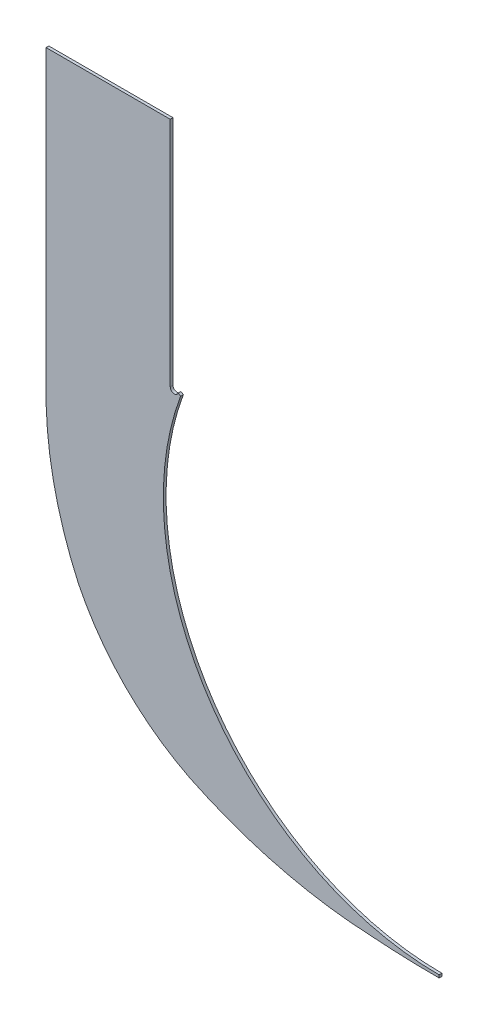
ISO-10303-21;
HEADER;
FILE_DESCRIPTION(('STEP AP214'),'2;1');
FILE_NAME('part.step','',(''),(''),'','','');
FILE_SCHEMA(('AUTOMOTIVE_DESIGN { 1 0 10303 214 1 1 1 1 }'));
ENDSEC;
DATA;
#1=APPLICATION_CONTEXT('core data for automotive mechanical design processes');
#2=APPLICATION_PROTOCOL_DEFINITION('international standard','automotive_design',2000,#1);
#3=PRODUCT_CONTEXT('',#1,'mechanical');
#4=PRODUCT('Part','Part','',(#3));
#5=PRODUCT_RELATED_PRODUCT_CATEGORY('part','',(#4));
#6=PRODUCT_DEFINITION_FORMATION('','',#4);
#7=PRODUCT_DEFINITION_CONTEXT('part definition',#1,'design');
#8=PRODUCT_DEFINITION('design','',#6,#7);
#9=PRODUCT_DEFINITION_SHAPE('','',#8);
#10=(LENGTH_UNIT() NAMED_UNIT(*) SI_UNIT(.MILLI.,.METRE.));
#11=(NAMED_UNIT(*) PLANE_ANGLE_UNIT() SI_UNIT($,.RADIAN.));
#12=(NAMED_UNIT(*) SI_UNIT($,.STERADIAN.) SOLID_ANGLE_UNIT());
#13=UNCERTAINTY_MEASURE_WITH_UNIT(LENGTH_MEASURE(1.E-05),#10,'distance_accuracy_value','');
#14=(GEOMETRIC_REPRESENTATION_CONTEXT(3) GLOBAL_UNCERTAINTY_ASSIGNED_CONTEXT((#13)) GLOBAL_UNIT_ASSIGNED_CONTEXT((#10,
#11,#12)) REPRESENTATION_CONTEXT('',''));
#15=CARTESIAN_POINT('',(0.,0.,0.));
#16=DIRECTION('',(0.,0.,1.));
#17=DIRECTION('',(1.,0.,0.));
#18=AXIS2_PLACEMENT_3D('',#15,#16,#17);
#19=CARTESIAN_POINT('',(-1.37729727140691,446.401820491641,-226.));
#20=DIRECTION('',(0.,0.,1.));
#21=DIRECTION('',(1.,0.,0.));
#22=AXIS2_PLACEMENT_3D('',#19,#20,#21);
#23=CYLINDRICAL_SURFACE('',#22,648.403283277196);
#24=CARTESIAN_POINT('',(-1.37729727140691,446.401820491641,-224.));
#25=DIRECTION('',(0.,0.,-1.));
#26=DIRECTION('',(-1.,0.,0.));
#27=AXIS2_PLACEMENT_3D('',#24,#25,#26);
#28=CIRCLE('',#27,648.403283277196);
#29=CARTESIAN_POINT('',(3.03576608295941E-13,-202.,-224.));
#30=VERTEX_POINT('',#29);
#31=CARTESIAN_POINT('',(-49.9999999999999,-200.175824145115,-224.));
#32=VERTEX_POINT('',#31);
#33=EDGE_CURVE('E161',#30,#32,#28,.T.);
#34=ORIENTED_EDGE('',*,*,#33,.T.);
#35=DIRECTION('',(0.,0.,1.));
#36=VECTOR('',#35,1.);
#37=CARTESIAN_POINT('',(-49.9999999999999,-200.175824145115,-226.));
#38=LINE('',#37,#36);
#39=CARTESIAN_POINT('',(-49.9999999999999,-200.175824145115,-226.));
#40=VERTEX_POINT('',#39);
#41=EDGE_CURVE('E11',#40,#32,#38,.T.);
#42=ORIENTED_EDGE('',*,*,#41,.F.);
#43=CARTESIAN_POINT('',(-1.37729727140691,446.401820491641,-226.));
#44=DIRECTION('',(0.,0.,-1.));
#45=DIRECTION('',(-1.,0.,0.));
#46=AXIS2_PLACEMENT_3D('',#43,#44,#45);
#47=CIRCLE('',#46,648.403283277196);
#48=CARTESIAN_POINT('',(3.03576608295941E-13,-202.,-226.));
#49=VERTEX_POINT('',#48);
#50=EDGE_CURVE('E192',#49,#40,#47,.T.);
#51=ORIENTED_EDGE('',*,*,#50,.F.);
#52=DIRECTION('',(0.,0.,1.));
#53=VECTOR('',#52,1.);
#54=CARTESIAN_POINT('',(3.03576608295941E-13,-202.,-226.));
#55=LINE('',#54,#53);
#56=EDGE_CURVE('E157',#49,#30,#55,.T.);
#57=ORIENTED_EDGE('',*,*,#56,.T.);
#58=EDGE_LOOP('',(#34,#42,#51,#57));
#59=FACE_BOUND('',#58,.T.);
#60=ADVANCED_FACE('F41',(#59),#23,.T.);
#61=CARTESIAN_POINT('',(-33.110750932078,138.674492238224,-226.));
#62=DIRECTION('',(0.,0.,1.));
#63=DIRECTION('',(1.,0.,0.));
#64=AXIS2_PLACEMENT_3D('',#61,#62,#63);
#65=CYLINDRICAL_SURFACE('',#64,339.270959038888);
#66=CARTESIAN_POINT('',(-33.110750932078,138.674492238224,-224.));
#67=DIRECTION('',(0.,0.,-1.));
#68=DIRECTION('',(-1.,0.,0.));
#69=AXIS2_PLACEMENT_3D('',#66,#67,#68);
#70=CIRCLE('',#69,339.270959038888);
#71=CARTESIAN_POINT('',(-180.8000328637,-166.763978897435,-224.));
#72=VERTEX_POINT('',#71);
#73=EDGE_CURVE('E165',#32,#72,#70,.T.);
#74=ORIENTED_EDGE('',*,*,#73,.T.);
#75=DIRECTION('',(0.,0.,1.));
#76=VECTOR('',#75,1.);
#77=CARTESIAN_POINT('',(-180.8000328637,-166.763978897435,-226.));
#78=LINE('',#77,#76);
#79=CARTESIAN_POINT('',(-180.8000328637,-166.763978897435,-226.));
#80=VERTEX_POINT('',#79);
#81=EDGE_CURVE('E50',#80,#72,#78,.T.);
#82=ORIENTED_EDGE('',*,*,#81,.F.);
#83=CARTESIAN_POINT('',(-33.110750932078,138.674492238224,-226.));
#84=DIRECTION('',(0.,0.,-1.));
#85=DIRECTION('',(-1.,0.,0.));
#86=AXIS2_PLACEMENT_3D('',#83,#84,#85);
#87=CIRCLE('',#86,339.270959038888);
#88=EDGE_CURVE('E110',#40,#80,#87,.T.);
#89=ORIENTED_EDGE('',*,*,#88,.F.);
#90=ORIENTED_EDGE('',*,*,#41,.T.);
#91=EDGE_LOOP('',(#74,#82,#89,#90));
#92=FACE_BOUND('',#91,.T.);
#93=ADVANCED_FACE('F270',(#92),#65,.T.);
#94=CARTESIAN_POINT('',(-99.0514370224912,-5.14773132945828,-226.));
#95=DIRECTION('',(0.,0.,1.));
#96=DIRECTION('',(1.,0.,0.));
#97=AXIS2_PLACEMENT_3D('',#94,#95,#96);
#98=CYLINDRICAL_SURFACE('',#97,181.115003243693);
#99=CARTESIAN_POINT('',(-99.0514370224912,-5.14773132945828,-224.));
#100=DIRECTION('',(0.,0.,-1.));
#101=DIRECTION('',(-1.,0.,0.));
#102=AXIS2_PLACEMENT_3D('',#99,#100,#101);
#103=CIRCLE('',#102,181.115003243693);
#104=CARTESIAN_POINT('',(-261.631018004088,-84.9632952741642,-224.));
#105=VERTEX_POINT('',#104);
#106=EDGE_CURVE('E168',#72,#105,#103,.T.);
#107=ORIENTED_EDGE('',*,*,#106,.T.);
#108=DIRECTION('',(0.,0.,1.));
#109=VECTOR('',#108,1.);
#110=CARTESIAN_POINT('',(-261.631018004088,-84.9632952741642,-226.));
#111=LINE('',#110,#109);
#112=CARTESIAN_POINT('',(-261.631018004088,-84.9632952741642,-226.));
#113=VERTEX_POINT('',#112);
#114=EDGE_CURVE('E215',#113,#105,#111,.T.);
#115=ORIENTED_EDGE('',*,*,#114,.F.);
#116=CARTESIAN_POINT('',(-99.0514370224912,-5.14773132945828,-226.));
#117=DIRECTION('',(0.,0.,-1.));
#118=DIRECTION('',(-1.,0.,0.));
#119=AXIS2_PLACEMENT_3D('',#116,#117,#118);
#120=CIRCLE('',#119,181.115003243693);
#121=EDGE_CURVE('E227',#80,#113,#120,.T.);
#122=ORIENTED_EDGE('',*,*,#121,.F.);
#123=ORIENTED_EDGE('',*,*,#81,.T.);
#124=EDGE_LOOP('',(#107,#115,#122,#123));
#125=FACE_BOUND('',#124,.T.);
#126=ADVANCED_FACE('F225',(#125),#98,.T.);
#127=CARTESIAN_POINT('',(-24.6103653669381,23.0639610541792,-226.));
#128=DIRECTION('',(0.,0.,1.));
#129=DIRECTION('',(1.,0.,0.));
#130=AXIS2_PLACEMENT_3D('',#127,#128,#129);
#131=CYLINDRICAL_SURFACE('',#130,260.477787702464);
#132=CARTESIAN_POINT('',(-24.6103653669381,23.0639610541792,-224.));
#133=DIRECTION('',(0.,0.,-1.));
#134=DIRECTION('',(-1.,0.,0.));
#135=AXIS2_PLACEMENT_3D('',#132,#133,#134);
#136=CIRCLE('',#135,260.477787702464);
#137=CARTESIAN_POINT('',(-285.,29.8401002226472,-224.));
#138=VERTEX_POINT('',#137);
#139=EDGE_CURVE('E171',#105,#138,#136,.T.);
#140=ORIENTED_EDGE('',*,*,#139,.T.);
#141=DIRECTION('',(0.,0.,1.));
#142=VECTOR('',#141,1.);
#143=CARTESIAN_POINT('',(-285.,29.8401002226472,-226.));
#144=LINE('',#143,#142);
#145=CARTESIAN_POINT('',(-285.,29.8401002226472,-226.));
#146=VERTEX_POINT('',#145);
#147=EDGE_CURVE('E211',#146,#138,#144,.T.);
#148=ORIENTED_EDGE('',*,*,#147,.F.);
#149=CARTESIAN_POINT('',(-24.6103653669381,23.0639610541792,-226.));
#150=DIRECTION('',(0.,0.,-1.));
#151=DIRECTION('',(-1.,0.,0.));
#152=AXIS2_PLACEMENT_3D('',#149,#150,#151);
#153=CIRCLE('',#152,260.477787702464);
#154=EDGE_CURVE('E245',#113,#146,#153,.T.);
#155=ORIENTED_EDGE('',*,*,#154,.F.);
#156=ORIENTED_EDGE('',*,*,#114,.T.);
#157=EDGE_LOOP('',(#140,#148,#155,#156));
#158=FACE_BOUND('',#157,.T.);
#159=ADVANCED_FACE('F236',(#158),#131,.T.);
#160=CARTESIAN_POINT('',(-285.,239.840100222647,-226.));
#161=DIRECTION('',(1.,0.,0.));
#162=DIRECTION('',(0.,0.,-1.));
#163=AXIS2_PLACEMENT_3D('',#160,#161,#162);
#164=PLANE('',#163);
#165=DIRECTION('',(0.,1.,0.));
#166=VECTOR('',#165,1.);
#167=CARTESIAN_POINT('',(-285.,239.840100222647,-224.));
#168=LINE('',#167,#166);
#169=CARTESIAN_POINT('',(-285.,239.840100222647,-224.));
#170=VERTEX_POINT('',#169);
#171=EDGE_CURVE('E174',#138,#170,#168,.T.);
#172=ORIENTED_EDGE('',*,*,#171,.T.);
#173=DIRECTION('',(0.,0.,1.));
#174=VECTOR('',#173,1.);
#175=CARTESIAN_POINT('',(-285.,239.840100222647,-226.));
#176=LINE('',#175,#174);
#177=CARTESIAN_POINT('',(-285.,239.840100222647,-226.));
#178=VERTEX_POINT('',#177);
#179=EDGE_CURVE('E207',#178,#170,#176,.T.);
#180=ORIENTED_EDGE('',*,*,#179,.F.);
#181=DIRECTION('',(0.,1.,0.));
#182=VECTOR('',#181,1.);
#183=CARTESIAN_POINT('',(-285.,239.840100222647,-226.));
#184=LINE('',#183,#182);
#185=EDGE_CURVE('E242',#146,#178,#184,.T.);
#186=ORIENTED_EDGE('',*,*,#185,.F.);
#187=ORIENTED_EDGE('',*,*,#147,.T.);
#188=EDGE_LOOP('',(#172,#180,#186,#187));
#189=FACE_BOUND('',#188,.T.);
#190=ADVANCED_FACE('F240',(#189),#164,.F.);
#191=CARTESIAN_POINT('',(-195.,239.840100222647,-226.));
#192=DIRECTION('',(0.,-1.,0.));
#193=DIRECTION('',(1.,0.,0.));
#194=AXIS2_PLACEMENT_3D('',#191,#192,#193);
#195=PLANE('',#194);
#196=DIRECTION('',(1.,0.,0.));
#197=VECTOR('',#196,1.);
#198=CARTESIAN_POINT('',(-195.,239.840100222647,-224.));
#199=LINE('',#198,#197);
#200=CARTESIAN_POINT('',(-195.,239.840100222647,-224.));
#201=VERTEX_POINT('',#200);
#202=EDGE_CURVE('E177',#170,#201,#199,.T.);
#203=ORIENTED_EDGE('',*,*,#202,.T.);
#204=DIRECTION('',(0.,0.,1.));
#205=VECTOR('',#204,1.);
#206=CARTESIAN_POINT('',(-195.,239.840100222647,-226.));
#207=LINE('',#206,#205);
#208=CARTESIAN_POINT('',(-195.,239.840100222647,-226.));
#209=VERTEX_POINT('',#208);
#210=EDGE_CURVE('E203',#209,#201,#207,.T.);
#211=ORIENTED_EDGE('',*,*,#210,.F.);
#212=DIRECTION('',(1.,0.,0.));
#213=VECTOR('',#212,1.);
#214=CARTESIAN_POINT('',(-195.,239.840100222647,-226.));
#215=LINE('',#214,#213);
#216=EDGE_CURVE('E244',#178,#209,#215,.T.);
#217=ORIENTED_EDGE('',*,*,#216,.F.);
#218=ORIENTED_EDGE('',*,*,#179,.T.);
#219=EDGE_LOOP('',(#203,#211,#217,#218));
#220=FACE_BOUND('',#219,.T.);
#221=ADVANCED_FACE('F282',(#220),#195,.F.);
#222=CARTESIAN_POINT('',(-195.,71.8401002226474,-226.));
#223=DIRECTION('',(-1.,0.,0.));
#224=DIRECTION('',(0.,0.,1.));
#225=AXIS2_PLACEMENT_3D('',#222,#223,#224);
#226=PLANE('',#225);
#227=DIRECTION('',(0.,-1.,0.));
#228=VECTOR('',#227,1.);
#229=CARTESIAN_POINT('',(-195.,71.8401002226474,-224.));
#230=LINE('',#229,#228);
#231=CARTESIAN_POINT('',(-195.,71.8401002226474,-224.));
#232=VERTEX_POINT('',#231);
#233=EDGE_CURVE('E180',#201,#232,#230,.T.);
#234=ORIENTED_EDGE('',*,*,#233,.T.);
#235=DIRECTION('',(0.,0.,1.));
#236=VECTOR('',#235,1.);
#237=CARTESIAN_POINT('',(-195.,71.8401002226474,-226.));
#238=LINE('',#237,#236);
#239=CARTESIAN_POINT('',(-195.,71.8401002226474,-226.));
#240=VERTEX_POINT('',#239);
#241=EDGE_CURVE('E199',#240,#232,#238,.T.);
#242=ORIENTED_EDGE('',*,*,#241,.F.);
#243=DIRECTION('',(0.,-1.,0.));
#244=VECTOR('',#243,1.);
#245=CARTESIAN_POINT('',(-195.,71.8401002226474,-226.));
#246=LINE('',#245,#244);
#247=EDGE_CURVE('E249',#209,#240,#246,.T.);
#248=ORIENTED_EDGE('',*,*,#247,.F.);
#249=ORIENTED_EDGE('',*,*,#210,.T.);
#250=EDGE_LOOP('',(#234,#242,#248,#249));
#251=FACE_BOUND('',#250,.T.);
#252=ADVANCED_FACE('F285',(#251),#226,.F.);
#253=CARTESIAN_POINT('',(-192.,71.8401002226474,-226.));
#254=DIRECTION('',(0.,0.,1.));
#255=DIRECTION('',(1.,0.,0.));
#256=AXIS2_PLACEMENT_3D('',#253,#254,#255);
#257=CYLINDRICAL_SURFACE('',#256,3.00000000000002);
#258=CARTESIAN_POINT('',(-192.,71.8401002226474,-224.));
#259=DIRECTION('',(0.,0.,1.));
#260=DIRECTION('',(-1.,0.,0.));
#261=AXIS2_PLACEMENT_3D('',#258,#259,#260);
#262=CIRCLE('',#261,3.00000000000002);
#263=CARTESIAN_POINT('',(-189.190243902439,70.7887816828037,-224.));
#264=VERTEX_POINT('',#263);
#265=EDGE_CURVE('E183',#232,#264,#262,.T.);
#266=ORIENTED_EDGE('',*,*,#265,.T.);
#267=DIRECTION('',(0.,0.,1.));
#268=VECTOR('',#267,1.);
#269=CARTESIAN_POINT('',(-189.190243902439,70.7887816828037,-226.));
#270=LINE('',#269,#268);
#271=CARTESIAN_POINT('',(-189.190243902439,70.7887816828037,-226.));
#272=VERTEX_POINT('',#271);
#273=EDGE_CURVE('E149',#272,#264,#270,.T.);
#274=ORIENTED_EDGE('',*,*,#273,.F.);
#275=CARTESIAN_POINT('',(-192.,71.8401002226474,-226.));
#276=DIRECTION('',(0.,0.,1.));
#277=DIRECTION('',(-1.,0.,0.));
#278=AXIS2_PLACEMENT_3D('',#275,#276,#277);
#279=CIRCLE('',#278,3.00000000000002);
#280=EDGE_CURVE('E138',#240,#272,#279,.T.);
#281=ORIENTED_EDGE('',*,*,#280,.F.);
#282=ORIENTED_EDGE('',*,*,#241,.T.);
#283=EDGE_LOOP('',(#266,#274,#281,#282));
#284=FACE_BOUND('',#283,.T.);
#285=ADVANCED_FACE('F289',(#284),#257,.F.);
#286=CARTESIAN_POINT('',(-187.489984113598,69.6240321805817,-226.));
#287=DIRECTION('',(-0.565151096192991,-0.824987417159717,0.));
#288=DIRECTION('',(0.824987417159717,-0.565151096192991,0.));
#289=AXIS2_PLACEMENT_3D('',#286,#287,#288);
#290=PLANE('',#289);
#291=DIRECTION('',(0.824987417159717,-0.565151096192991,0.));
#292=VECTOR('',#291,1.);
#293=CARTESIAN_POINT('',(-187.489984113598,69.6240321805817,-224.));
#294=LINE('',#293,#292);
#295=CARTESIAN_POINT('',(-187.489984113598,69.6240321805817,-224.));
#296=VERTEX_POINT('',#295);
#297=EDGE_CURVE('E147',#264,#296,#294,.T.);
#298=ORIENTED_EDGE('',*,*,#297,.T.);
#299=DIRECTION('',(0.,0.,1.));
#300=VECTOR('',#299,1.);
#301=CARTESIAN_POINT('',(-187.489984113598,69.6240321805817,-226.));
#302=LINE('',#301,#300);
#303=CARTESIAN_POINT('',(-187.489984113598,69.6240321805817,-226.));
#304=VERTEX_POINT('',#303);
#305=EDGE_CURVE('E144',#304,#296,#302,.T.);
#306=ORIENTED_EDGE('',*,*,#305,.F.);
#307=DIRECTION('',(0.824987417159717,-0.565151096192991,0.));
#308=VECTOR('',#307,1.);
#309=CARTESIAN_POINT('',(-187.489984113598,69.6240321805817,-226.));
#310=LINE('',#309,#308);
#311=EDGE_CURVE('E132',#272,#304,#310,.T.);
#312=ORIENTED_EDGE('',*,*,#311,.F.);
#313=ORIENTED_EDGE('',*,*,#273,.T.);
#314=EDGE_LOOP('',(#298,#306,#312,#313));
#315=FACE_BOUND('',#314,.T.);
#316=ADVANCED_FACE('F145',(#315),#290,.F.);
#317=CARTESIAN_POINT('',(0.,0.,-226.));
#318=DIRECTION('',(0.,0.,1.));
#319=DIRECTION('',(1.,0.,0.));
#320=AXIS2_PLACEMENT_3D('',#317,#318,#319);
#321=CYLINDRICAL_SURFACE('',#320,200.);
#322=CARTESIAN_POINT('',(0.,0.,-224.));
#323=DIRECTION('',(0.,0.,1.));
#324=DIRECTION('',(-1.,0.,0.));
#325=AXIS2_PLACEMENT_3D('',#322,#323,#324);
#326=CIRCLE('',#325,200.);
#327=CARTESIAN_POINT('',(0.000776104824012761,-199.999999998494,-224.));
#328=VERTEX_POINT('',#327);
#329=EDGE_CURVE('E96',#296,#328,#326,.T.);
#330=ORIENTED_EDGE('',*,*,#329,.T.);
#331=DIRECTION('',(0.,0.,1.));
#332=VECTOR('',#331,1.);
#333=CARTESIAN_POINT('',(0.000776104824012761,-199.999999998494,-226.));
#334=LINE('',#333,#332);
#335=CARTESIAN_POINT('',(0.000776104824012761,-199.999999998494,-226.));
#336=VERTEX_POINT('',#335);
#337=EDGE_CURVE('E150',#336,#328,#334,.T.);
#338=ORIENTED_EDGE('',*,*,#337,.F.);
#339=CARTESIAN_POINT('',(0.,0.,-226.));
#340=DIRECTION('',(0.,0.,1.));
#341=DIRECTION('',(-1.,0.,0.));
#342=AXIS2_PLACEMENT_3D('',#339,#340,#341);
#343=CIRCLE('',#342,200.);
#344=EDGE_CURVE('E136',#304,#336,#343,.T.);
#345=ORIENTED_EDGE('',*,*,#344,.F.);
#346=ORIENTED_EDGE('',*,*,#305,.T.);
#347=EDGE_LOOP('',(#330,#338,#345,#346));
#348=FACE_BOUND('',#347,.T.);
#349=ADVANCED_FACE('F152',(#348),#321,.F.);
#350=CARTESIAN_POINT('',(0.000776104824012761,-199.999999998494,-226.));
#351=DIRECTION('',(-0.999999924707671,0.000388052382345058,0.));
#352=DIRECTION('',(-0.000388052382345058,-0.999999924707672,0.));
#353=AXIS2_PLACEMENT_3D('',#350,#351,#352);
#354=PLANE('',#353);
#355=DIRECTION('',(-0.000388052382345058,-0.999999924707672,0.));
#356=VECTOR('',#355,1.);
#357=CARTESIAN_POINT('',(0.000776104824012761,-199.999999998494,-224.));
#358=LINE('',#357,#356);
#359=EDGE_CURVE('E102',#328,#30,#358,.T.);
#360=ORIENTED_EDGE('',*,*,#359,.T.);
#361=ORIENTED_EDGE('',*,*,#56,.F.);
#362=DIRECTION('',(-0.000388052382345058,-0.999999924707672,0.));
#363=VECTOR('',#362,1.);
#364=CARTESIAN_POINT('',(0.000776104824012761,-199.999999998494,-226.));
#365=LINE('',#364,#363);
#366=EDGE_CURVE('E58',#336,#49,#365,.T.);
#367=ORIENTED_EDGE('',*,*,#366,.F.);
#368=ORIENTED_EDGE('',*,*,#337,.T.);
#369=EDGE_LOOP('',(#360,#361,#367,#368));
#370=FACE_BOUND('',#369,.T.);
#371=ADVANCED_FACE('F298',(#370),#354,.F.);
#372=CARTESIAN_POINT('',(-1.37729727140691,446.401820491641,-226.));
#373=DIRECTION('',(0.,0.,-1.));
#374=DIRECTION('',(-1.,0.,0.));
#375=AXIS2_PLACEMENT_3D('',#372,#373,#374);
#376=PLANE('',#375);
#377=ORIENTED_EDGE('',*,*,#50,.T.);
#378=ORIENTED_EDGE('',*,*,#88,.T.);
#379=ORIENTED_EDGE('',*,*,#121,.T.);
#380=ORIENTED_EDGE('',*,*,#154,.T.);
#381=ORIENTED_EDGE('',*,*,#185,.T.);
#382=ORIENTED_EDGE('',*,*,#216,.T.);
#383=ORIENTED_EDGE('',*,*,#247,.T.);
#384=ORIENTED_EDGE('',*,*,#280,.T.);
#385=ORIENTED_EDGE('',*,*,#311,.T.);
#386=ORIENTED_EDGE('',*,*,#344,.T.);
#387=ORIENTED_EDGE('',*,*,#366,.T.);
#388=EDGE_LOOP('',(#377,#378,#379,#380,#381,#382,#383,#384,#385,#386,#387));
#389=FACE_BOUND('',#388,.T.);
#390=ADVANCED_FACE('F134',(#389),#376,.T.);
#391=CARTESIAN_POINT('',(-1.37729727140691,446.401820491641,-224.));
#392=DIRECTION('',(0.,0.,-1.));
#393=DIRECTION('',(-1.,0.,0.));
#394=AXIS2_PLACEMENT_3D('',#391,#392,#393);
#395=PLANE('',#394);
#396=ORIENTED_EDGE('',*,*,#33,.F.);
#397=ORIENTED_EDGE('',*,*,#359,.F.);
#398=ORIENTED_EDGE('',*,*,#329,.F.);
#399=ORIENTED_EDGE('',*,*,#297,.F.);
#400=ORIENTED_EDGE('',*,*,#265,.F.);
#401=ORIENTED_EDGE('',*,*,#233,.F.);
#402=ORIENTED_EDGE('',*,*,#202,.F.);
#403=ORIENTED_EDGE('',*,*,#171,.F.);
#404=ORIENTED_EDGE('',*,*,#139,.F.);
#405=ORIENTED_EDGE('',*,*,#106,.F.);
#406=ORIENTED_EDGE('',*,*,#73,.F.);
#407=EDGE_LOOP('',(#396,#397,#398,#399,#400,#401,#402,#403,#404,#405,#406));
#408=FACE_BOUND('',#407,.T.);
#409=ADVANCED_FACE('F231',(#408),#395,.F.);
#410=CLOSED_SHELL('',(#60,#93,#126,#159,#190,#221,#252,#285,#316,#349,#371,#390,#409));
#411=MANIFOLD_SOLID_BREP('B2',#410);
#412=ADVANCED_BREP_SHAPE_REPRESENTATION('',(#18,#411),#14);
#413=SHAPE_DEFINITION_REPRESENTATION(#9,#412);
ENDSEC;
END-ISO-10303-21;
